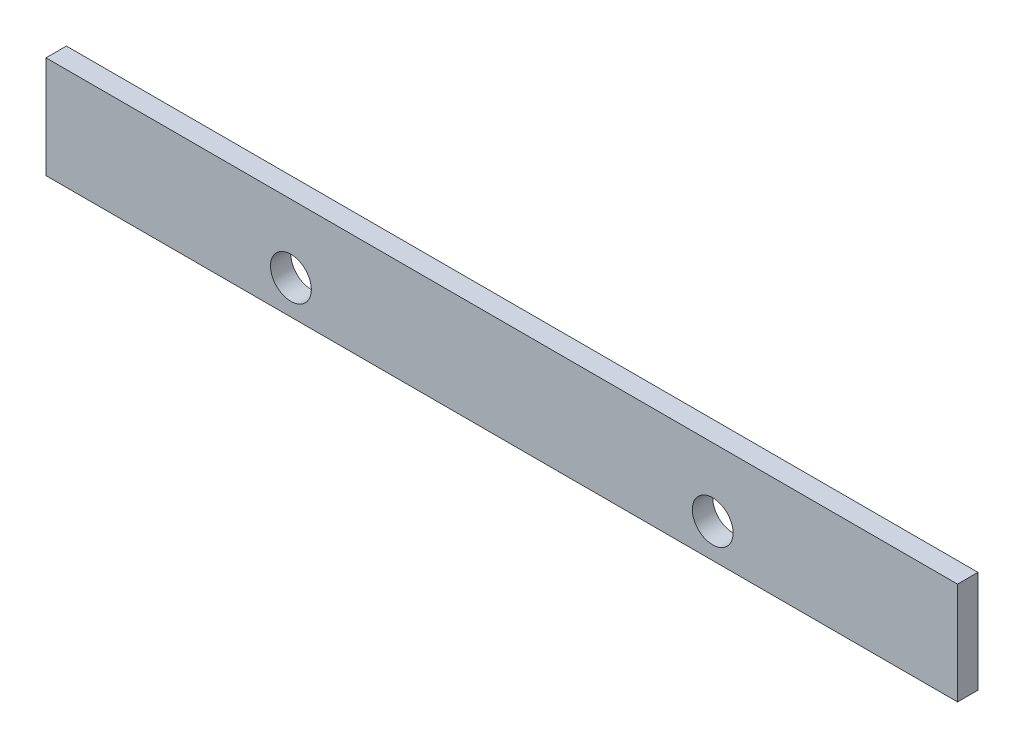
ISO-10303-21;
HEADER;
FILE_DESCRIPTION(('STEP AP214'),'2;1');
FILE_NAME('part.step','',(''),(''),'','','');
FILE_SCHEMA(('AUTOMOTIVE_DESIGN { 1 0 10303 214 1 1 1 1 }'));
ENDSEC;
DATA;
#1=APPLICATION_CONTEXT('core data for automotive mechanical design processes');
#2=APPLICATION_PROTOCOL_DEFINITION('international standard','automotive_design',2000,#1);
#3=PRODUCT_CONTEXT('',#1,'mechanical');
#4=PRODUCT('Part','Part','',(#3));
#5=PRODUCT_RELATED_PRODUCT_CATEGORY('part','',(#4));
#6=PRODUCT_DEFINITION_FORMATION('','',#4);
#7=PRODUCT_DEFINITION_CONTEXT('part definition',#1,'design');
#8=PRODUCT_DEFINITION('design','',#6,#7);
#9=PRODUCT_DEFINITION_SHAPE('','',#8);
#10=(LENGTH_UNIT() NAMED_UNIT(*) SI_UNIT(.MILLI.,.METRE.));
#11=(NAMED_UNIT(*) PLANE_ANGLE_UNIT() SI_UNIT($,.RADIAN.));
#12=(NAMED_UNIT(*) SI_UNIT($,.STERADIAN.) SOLID_ANGLE_UNIT());
#13=UNCERTAINTY_MEASURE_WITH_UNIT(LENGTH_MEASURE(1.E-05),#10,'distance_accuracy_value','');
#14=(GEOMETRIC_REPRESENTATION_CONTEXT(3) GLOBAL_UNCERTAINTY_ASSIGNED_CONTEXT((#13)) GLOBAL_UNIT_ASSIGNED_CONTEXT((#10,
#11,#12)) REPRESENTATION_CONTEXT('',''));
#15=CARTESIAN_POINT('',(0.,0.,0.));
#16=DIRECTION('',(0.,0.,1.));
#17=DIRECTION('',(1.,0.,0.));
#18=AXIS2_PLACEMENT_3D('',#15,#16,#17);
#19=CARTESIAN_POINT('',(67.,7.5,3.));
#20=DIRECTION('',(-1.,0.,0.));
#21=DIRECTION('',(0.,0.,1.));
#22=AXIS2_PLACEMENT_3D('',#19,#20,#21);
#23=PLANE('',#22);
#24=DIRECTION('',(0.,1.,0.));
#25=VECTOR('',#24,1.);
#26=CARTESIAN_POINT('',(67.,7.5,0.));
#27=LINE('',#26,#25);
#28=CARTESIAN_POINT('',(67.,-7.5,0.));
#29=VERTEX_POINT('',#28);
#30=CARTESIAN_POINT('',(67.,7.5,0.));
#31=VERTEX_POINT('',#30);
#32=EDGE_CURVE('E107',#29,#31,#27,.T.);
#33=ORIENTED_EDGE('',*,*,#32,.T.);
#34=DIRECTION('',(0.,0.,-1.));
#35=VECTOR('',#34,1.);
#36=CARTESIAN_POINT('',(67.,7.5,3.));
#37=LINE('',#36,#35);
#38=CARTESIAN_POINT('',(67.,7.5,3.));
#39=VERTEX_POINT('',#38);
#40=EDGE_CURVE('E11',#39,#31,#37,.T.);
#41=ORIENTED_EDGE('',*,*,#40,.F.);
#42=DIRECTION('',(0.,1.,0.));
#43=VECTOR('',#42,1.);
#44=CARTESIAN_POINT('',(67.,7.5,3.));
#45=LINE('',#44,#43);
#46=CARTESIAN_POINT('',(67.,-7.5,3.));
#47=VERTEX_POINT('',#46);
#48=EDGE_CURVE('E91',#47,#39,#45,.T.);
#49=ORIENTED_EDGE('',*,*,#48,.F.);
#50=DIRECTION('',(0.,0.,-1.));
#51=VECTOR('',#50,1.);
#52=CARTESIAN_POINT('',(67.,-7.5,3.));
#53=LINE('',#52,#51);
#54=EDGE_CURVE('E103',#47,#29,#53,.T.);
#55=ORIENTED_EDGE('',*,*,#54,.T.);
#56=EDGE_LOOP('',(#33,#41,#49,#55));
#57=FACE_BOUND('',#56,.T.);
#58=ADVANCED_FACE('F39',(#57),#23,.F.);
#59=CARTESIAN_POINT('',(-67.,7.5,3.));
#60=DIRECTION('',(0.,-1.,0.));
#61=DIRECTION('',(0.,0.,-1.));
#62=AXIS2_PLACEMENT_3D('',#59,#60,#61);
#63=PLANE('',#62);
#64=DIRECTION('',(-1.,0.,0.));
#65=VECTOR('',#64,1.);
#66=CARTESIAN_POINT('',(-67.,7.5,0.));
#67=LINE('',#66,#65);
#68=CARTESIAN_POINT('',(-67.,7.5,0.));
#69=VERTEX_POINT('',#68);
#70=EDGE_CURVE('E96',#31,#69,#67,.T.);
#71=ORIENTED_EDGE('',*,*,#70,.T.);
#72=DIRECTION('',(0.,0.,-1.));
#73=VECTOR('',#72,1.);
#74=CARTESIAN_POINT('',(-67.,7.5,3.));
#75=LINE('',#74,#73);
#76=CARTESIAN_POINT('',(-67.,7.5,3.));
#77=VERTEX_POINT('',#76);
#78=EDGE_CURVE('E48',#77,#69,#75,.T.);
#79=ORIENTED_EDGE('',*,*,#78,.F.);
#80=DIRECTION('',(-1.,0.,0.));
#81=VECTOR('',#80,1.);
#82=CARTESIAN_POINT('',(-67.,7.5,3.));
#83=LINE('',#82,#81);
#84=EDGE_CURVE('E86',#39,#77,#83,.T.);
#85=ORIENTED_EDGE('',*,*,#84,.F.);
#86=ORIENTED_EDGE('',*,*,#40,.T.);
#87=EDGE_LOOP('',(#71,#79,#85,#86));
#88=FACE_BOUND('',#87,.T.);
#89=ADVANCED_FACE('F95',(#88),#63,.F.);
#90=CARTESIAN_POINT('',(-67.,7.5,3.));
#91=DIRECTION('',(1.,0.,0.));
#92=DIRECTION('',(0.,0.,-1.));
#93=AXIS2_PLACEMENT_3D('',#90,#91,#92);
#94=PLANE('',#93);
#95=DIRECTION('',(0.,-1.,0.));
#96=VECTOR('',#95,1.);
#97=CARTESIAN_POINT('',(-67.,7.5,0.));
#98=LINE('',#97,#96);
#99=CARTESIAN_POINT('',(-67.,-7.5,0.));
#100=VERTEX_POINT('',#99);
#101=EDGE_CURVE('E73',#69,#100,#98,.T.);
#102=ORIENTED_EDGE('',*,*,#101,.T.);
#103=DIRECTION('',(0.,0.,-1.));
#104=VECTOR('',#103,1.);
#105=CARTESIAN_POINT('',(-67.,-7.5,3.));
#106=LINE('',#105,#104);
#107=CARTESIAN_POINT('',(-67.,-7.5,3.));
#108=VERTEX_POINT('',#107);
#109=EDGE_CURVE('E98',#108,#100,#106,.T.);
#110=ORIENTED_EDGE('',*,*,#109,.F.);
#111=DIRECTION('',(0.,-1.,0.));
#112=VECTOR('',#111,1.);
#113=CARTESIAN_POINT('',(-67.,7.5,3.));
#114=LINE('',#113,#112);
#115=EDGE_CURVE('E89',#77,#108,#114,.T.);
#116=ORIENTED_EDGE('',*,*,#115,.F.);
#117=ORIENTED_EDGE('',*,*,#78,.T.);
#118=EDGE_LOOP('',(#102,#110,#116,#117));
#119=FACE_BOUND('',#118,.T.);
#120=ADVANCED_FACE('F99',(#119),#94,.F.);
#121=CARTESIAN_POINT('',(-67.,-7.5,3.));
#122=DIRECTION('',(0.,1.,0.));
#123=DIRECTION('',(0.,0.,1.));
#124=AXIS2_PLACEMENT_3D('',#121,#122,#123);
#125=PLANE('',#124);
#126=DIRECTION('',(1.,0.,0.));
#127=VECTOR('',#126,1.);
#128=CARTESIAN_POINT('',(-67.,-7.5,0.));
#129=LINE('',#128,#127);
#130=EDGE_CURVE('E79',#100,#29,#129,.T.);
#131=ORIENTED_EDGE('',*,*,#130,.T.);
#132=ORIENTED_EDGE('',*,*,#54,.F.);
#133=DIRECTION('',(1.,0.,0.));
#134=VECTOR('',#133,1.);
#135=CARTESIAN_POINT('',(-67.,-7.5,3.));
#136=LINE('',#135,#134);
#137=EDGE_CURVE('E56',#108,#47,#136,.T.);
#138=ORIENTED_EDGE('',*,*,#137,.F.);
#139=ORIENTED_EDGE('',*,*,#109,.T.);
#140=EDGE_LOOP('',(#131,#132,#138,#139));
#141=FACE_BOUND('',#140,.T.);
#142=ADVANCED_FACE('F121',(#141),#125,.F.);
#143=CARTESIAN_POINT('',(0.,0.,3.));
#144=DIRECTION('',(0.,0.,1.));
#145=DIRECTION('',(1.,0.,0.));
#146=AXIS2_PLACEMENT_3D('',#143,#144,#145);
#147=PLANE('',#146);
#148=CARTESIAN_POINT('',(-31.,-2.5,3.));
#149=DIRECTION('',(0.,0.,-1.));
#150=DIRECTION('',(-1.,0.,0.));
#151=AXIS2_PLACEMENT_3D('',#148,#149,#150);
#152=CIRCLE('',#151,3.);
#153=CARTESIAN_POINT('',(-34.,-2.5,3.));
#154=VERTEX_POINT('',#153);
#155=EDGE_CURVE('E132',#154,#154,#152,.T.);
#156=ORIENTED_EDGE('',*,*,#155,.T.);
#157=EDGE_LOOP('',(#156));
#158=FACE_BOUND('',#157,.T.);
#159=CARTESIAN_POINT('',(31.,-2.5,3.));
#160=DIRECTION('',(0.,0.,-1.));
#161=DIRECTION('',(-1.,0.,0.));
#162=AXIS2_PLACEMENT_3D('',#159,#160,#161);
#163=CIRCLE('',#162,3.);
#164=CARTESIAN_POINT('',(28.,-2.5,3.));
#165=VERTEX_POINT('',#164);
#166=EDGE_CURVE('E111',#165,#165,#163,.T.);
#167=ORIENTED_EDGE('',*,*,#166,.T.);
#168=EDGE_LOOP('',(#167));
#169=FACE_BOUND('',#168,.T.);
#170=ORIENTED_EDGE('',*,*,#48,.T.);
#171=ORIENTED_EDGE('',*,*,#84,.T.);
#172=ORIENTED_EDGE('',*,*,#115,.T.);
#173=ORIENTED_EDGE('',*,*,#137,.T.);
#174=EDGE_LOOP('',(#170,#171,#172,#173));
#175=FACE_BOUND('',#174,.T.);
#176=ADVANCED_FACE('F87',(#158,#169,#175),#147,.T.);
#177=CARTESIAN_POINT('',(0.,0.,0.));
#178=DIRECTION('',(0.,0.,1.));
#179=DIRECTION('',(1.,0.,0.));
#180=AXIS2_PLACEMENT_3D('',#177,#178,#179);
#181=PLANE('',#180);
#182=CARTESIAN_POINT('',(-31.,-2.5,0.));
#183=DIRECTION('',(0.,0.,-1.));
#184=DIRECTION('',(-1.,0.,0.));
#185=AXIS2_PLACEMENT_3D('',#182,#183,#184);
#186=CIRCLE('',#185,3.);
#187=CARTESIAN_POINT('',(-34.,-2.5,0.));
#188=VERTEX_POINT('',#187);
#189=EDGE_CURVE('E136',#188,#188,#186,.T.);
#190=ORIENTED_EDGE('',*,*,#189,.F.);
#191=EDGE_LOOP('',(#190));
#192=FACE_BOUND('',#191,.T.);
#193=CARTESIAN_POINT('',(31.,-2.5,0.));
#194=DIRECTION('',(0.,0.,-1.));
#195=DIRECTION('',(-1.,0.,0.));
#196=AXIS2_PLACEMENT_3D('',#193,#194,#195);
#197=CIRCLE('',#196,3.);
#198=CARTESIAN_POINT('',(28.,-2.5,0.));
#199=VERTEX_POINT('',#198);
#200=EDGE_CURVE('E128',#199,#199,#197,.T.);
#201=ORIENTED_EDGE('',*,*,#200,.F.);
#202=EDGE_LOOP('',(#201));
#203=FACE_BOUND('',#202,.T.);
#204=ORIENTED_EDGE('',*,*,#32,.F.);
#205=ORIENTED_EDGE('',*,*,#130,.F.);
#206=ORIENTED_EDGE('',*,*,#101,.F.);
#207=ORIENTED_EDGE('',*,*,#70,.F.);
#208=EDGE_LOOP('',(#204,#205,#206,#207));
#209=FACE_BOUND('',#208,.T.);
#210=ADVANCED_FACE('F124',(#192,#203,#209),#181,.F.);
#211=CARTESIAN_POINT('',(31.,-2.5,3.));
#212=DIRECTION('',(0.,0.,-1.));
#213=DIRECTION('',(-1.,0.,0.));
#214=AXIS2_PLACEMENT_3D('',#211,#212,#213);
#215=CYLINDRICAL_SURFACE('',#214,3.);
#216=ORIENTED_EDGE('',*,*,#166,.F.);
#217=EDGE_LOOP('',(#216));
#218=FACE_BOUND('',#217,.T.);
#219=ORIENTED_EDGE('',*,*,#200,.T.);
#220=EDGE_LOOP('',(#219));
#221=FACE_BOUND('',#220,.T.);
#222=ADVANCED_FACE('F149',(#218,#221),#215,.F.);
#223=CARTESIAN_POINT('',(-31.,-2.5,3.));
#224=DIRECTION('',(0.,0.,-1.));
#225=DIRECTION('',(-1.,0.,0.));
#226=AXIS2_PLACEMENT_3D('',#223,#224,#225);
#227=CYLINDRICAL_SURFACE('',#226,3.);
#228=ORIENTED_EDGE('',*,*,#155,.F.);
#229=EDGE_LOOP('',(#228));
#230=FACE_BOUND('',#229,.T.);
#231=ORIENTED_EDGE('',*,*,#189,.T.);
#232=EDGE_LOOP('',(#231));
#233=FACE_BOUND('',#232,.T.);
#234=ADVANCED_FACE('F146',(#230,#233),#227,.F.);
#235=CLOSED_SHELL('',(#58,#89,#120,#142,#176,#210,#222,#234));
#236=MANIFOLD_SOLID_BREP('B2',#235);
#237=ADVANCED_BREP_SHAPE_REPRESENTATION('',(#18,#236),#14);
#238=SHAPE_DEFINITION_REPRESENTATION(#9,#237);
ENDSEC;
END-ISO-10303-21;
